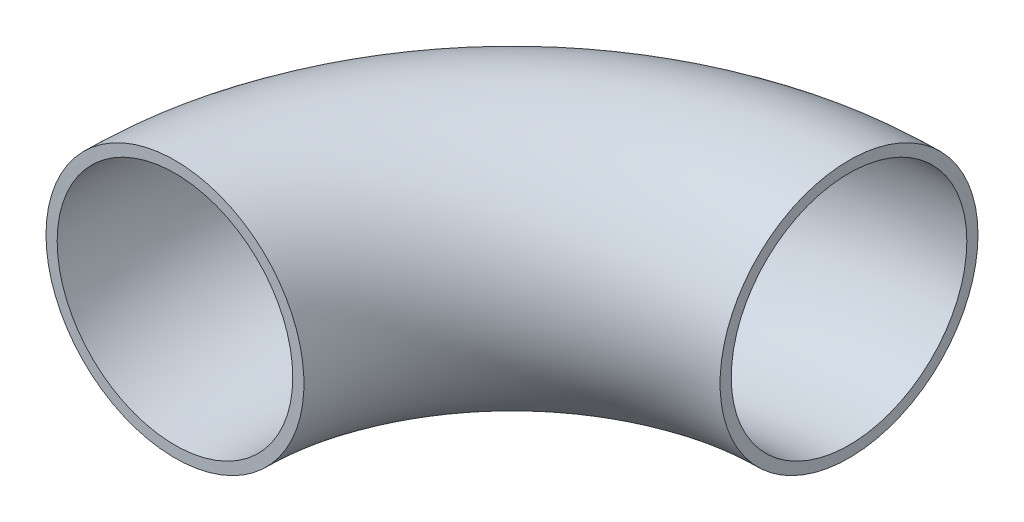
ISO-10303-21;
HEADER;
FILE_DESCRIPTION(('STEP AP214'),'2;1');
FILE_NAME('part.step','',(''),(''),'','','');
FILE_SCHEMA(('AUTOMOTIVE_DESIGN { 1 0 10303 214 1 1 1 1 }'));
ENDSEC;
DATA;
#1=APPLICATION_CONTEXT('core data for automotive mechanical design processes');
#2=APPLICATION_PROTOCOL_DEFINITION('international standard','automotive_design',2000,#1);
#3=PRODUCT_CONTEXT('',#1,'mechanical');
#4=PRODUCT('Part','Part','',(#3));
#5=PRODUCT_RELATED_PRODUCT_CATEGORY('part','',(#4));
#6=PRODUCT_DEFINITION_FORMATION('','',#4);
#7=PRODUCT_DEFINITION_CONTEXT('part definition',#1,'design');
#8=PRODUCT_DEFINITION('design','',#6,#7);
#9=PRODUCT_DEFINITION_SHAPE('','',#8);
#10=(LENGTH_UNIT() NAMED_UNIT(*) SI_UNIT(.MILLI.,.METRE.));
#11=(NAMED_UNIT(*) PLANE_ANGLE_UNIT() SI_UNIT($,.RADIAN.));
#12=(NAMED_UNIT(*) SI_UNIT($,.STERADIAN.) SOLID_ANGLE_UNIT());
#13=UNCERTAINTY_MEASURE_WITH_UNIT(LENGTH_MEASURE(1.E-05),#10,'distance_accuracy_value','');
#14=(GEOMETRIC_REPRESENTATION_CONTEXT(3) GLOBAL_UNCERTAINTY_ASSIGNED_CONTEXT((#13)) GLOBAL_UNIT_ASSIGNED_CONTEXT((#10,
#11,#12)) REPRESENTATION_CONTEXT('',''));
#15=CARTESIAN_POINT('',(0.,0.,0.));
#16=DIRECTION('',(0.,0.,1.));
#17=DIRECTION('',(1.,0.,0.));
#18=AXIS2_PLACEMENT_3D('',#15,#16,#17);
#19=CARTESIAN_POINT('',(0.,0.,0.));
#20=DIRECTION('',(0.,-1.,0.));
#21=DIRECTION('',(0.,0.,-1.));
#22=AXIS2_PLACEMENT_3D('',#19,#20,#21);
#23=TOROIDAL_SURFACE('',#22,49.784,19.05);
#24=CARTESIAN_POINT('',(-49.784,0.,0.));
#25=DIRECTION('',(0.,0.,1.));
#26=DIRECTION('',(1.,0.,0.));
#27=AXIS2_PLACEMENT_3D('',#24,#25,#26);
#28=CIRCLE('',#27,19.05);
#29=CARTESIAN_POINT('',(-68.834,0.,0.));
#30=VERTEX_POINT('',#29);
#31=EDGE_CURVE('E10',#30,#30,#28,.T.);
#32=CARTESIAN_POINT('',(0.,0.,-49.784));
#33=DIRECTION('',(-1.,0.,0.));
#34=DIRECTION('',(0.,0.,1.));
#35=AXIS2_PLACEMENT_3D('',#32,#33,#34);
#36=CIRCLE('',#35,19.05);
#37=CARTESIAN_POINT('',(0.,0.,-68.834));
#38=VERTEX_POINT('',#37);
#39=EDGE_CURVE('E36',#38,#38,#36,.T.);
#40=CARTESIAN_POINT('',(0.,0.,0.));
#41=DIRECTION('',(0.,-1.,0.));
#42=DIRECTION('',(0.,0.,-1.));
#43=AXIS2_PLACEMENT_3D('',#40,#41,#42);
#44=CIRCLE('',#43,68.834);
#45=EDGE_CURVE('',#30,#38,#44,.T.);
#46=ORIENTED_EDGE('',*,*,#31,.F.);
#47=ORIENTED_EDGE('',*,*,#39,.T.);
#48=ORIENTED_EDGE('',*,*,#45,.T.);
#49=ORIENTED_EDGE('',*,*,#45,.F.);
#50=EDGE_LOOP('',(#46,#48,#47,#49));
#51=FACE_BOUND('',#50,.T.);
#52=ADVANCED_FACE('F30',(#51),#23,.T.);
#53=CARTESIAN_POINT('',(-49.784,0.,0.));
#54=DIRECTION('',(0.,0.,1.));
#55=DIRECTION('',(1.,0.,0.));
#56=AXIS2_PLACEMENT_3D('',#53,#54,#55);
#57=PLANE('',#56);
#58=CARTESIAN_POINT('',(-49.784,0.,0.));
#59=DIRECTION('',(0.,0.,1.));
#60=DIRECTION('',(1.,0.,0.));
#61=AXIS2_PLACEMENT_3D('',#58,#59,#60);
#62=CIRCLE('',#61,17.399);
#63=CARTESIAN_POINT('',(-67.183,0.,0.));
#64=VERTEX_POINT('',#63);
#65=EDGE_CURVE('E40',#64,#64,#62,.T.);
#66=ORIENTED_EDGE('',*,*,#65,.F.);
#67=EDGE_LOOP('',(#66));
#68=FACE_BOUND('',#67,.T.);
#69=ORIENTED_EDGE('',*,*,#31,.T.);
#70=EDGE_LOOP('',(#69));
#71=FACE_BOUND('',#70,.T.);
#72=ADVANCED_FACE('F60',(#68,#71),#57,.T.);
#73=CARTESIAN_POINT('',(0.,0.,-49.784));
#74=DIRECTION('',(-1.,0.,0.));
#75=DIRECTION('',(0.,0.,1.));
#76=AXIS2_PLACEMENT_3D('',#73,#74,#75);
#77=PLANE('',#76);
#78=CARTESIAN_POINT('',(0.,0.,-49.784));
#79=DIRECTION('',(-1.,0.,0.));
#80=DIRECTION('',(0.,0.,1.));
#81=AXIS2_PLACEMENT_3D('',#78,#79,#80);
#82=CIRCLE('',#81,17.399);
#83=CARTESIAN_POINT('',(0.,0.,-67.183));
#84=VERTEX_POINT('',#83);
#85=EDGE_CURVE('E44',#84,#84,#82,.T.);
#86=ORIENTED_EDGE('',*,*,#85,.T.);
#87=EDGE_LOOP('',(#86));
#88=FACE_BOUND('',#87,.T.);
#89=ORIENTED_EDGE('',*,*,#39,.F.);
#90=EDGE_LOOP('',(#89));
#91=FACE_BOUND('',#90,.T.);
#92=ADVANCED_FACE('F50',(#88,#91),#77,.F.);
#93=CARTESIAN_POINT('',(0.,0.,0.));
#94=DIRECTION('',(0.,-1.,0.));
#95=DIRECTION('',(0.,0.,-1.));
#96=AXIS2_PLACEMENT_3D('',#93,#94,#95);
#97=TOROIDAL_SURFACE('',#96,49.784,17.399);
#98=CARTESIAN_POINT('',(0.,0.,0.));
#99=DIRECTION('',(0.,-1.,0.));
#100=DIRECTION('',(0.,0.,-1.));
#101=AXIS2_PLACEMENT_3D('',#98,#99,#100);
#102=CIRCLE('',#101,67.183);
#103=EDGE_CURVE('',#64,#84,#102,.T.);
#104=ORIENTED_EDGE('',*,*,#65,.T.);
#105=ORIENTED_EDGE('',*,*,#85,.F.);
#106=ORIENTED_EDGE('',*,*,#103,.T.);
#107=ORIENTED_EDGE('',*,*,#103,.F.);
#108=EDGE_LOOP('',(#104,#106,#105,#107));
#109=FACE_BOUND('',#108,.T.);
#110=ADVANCED_FACE('F53',(#109),#97,.F.);
#111=CLOSED_SHELL('',(#52,#72,#92,#110));
#112=MANIFOLD_SOLID_BREP('B2',#111);
#113=ADVANCED_BREP_SHAPE_REPRESENTATION('',(#18,#112),#14);
#114=SHAPE_DEFINITION_REPRESENTATION(#9,#113);
ENDSEC;
END-ISO-10303-21;
